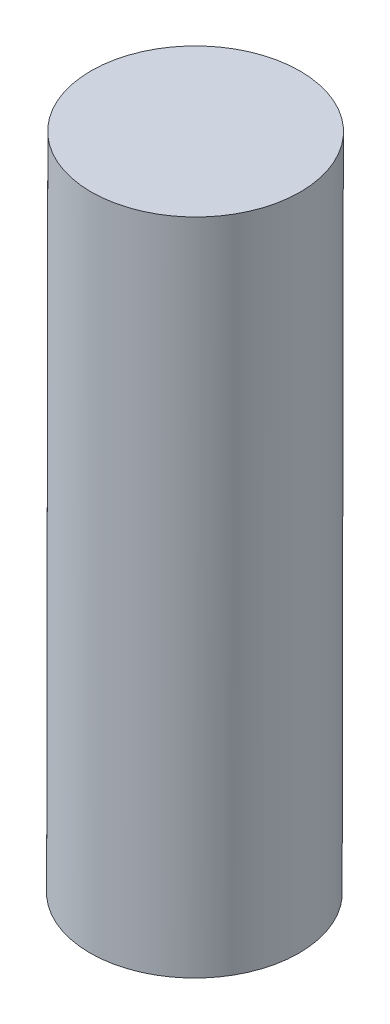
ISO-10303-21;
HEADER;
FILE_DESCRIPTION(('STEP AP214'),'2;1');
FILE_NAME('part.step','',(''),(''),'','','');
FILE_SCHEMA(('AUTOMOTIVE_DESIGN { 1 0 10303 214 1 1 1 1 }'));
ENDSEC;
DATA;
#1=APPLICATION_CONTEXT('core data for automotive mechanical design processes');
#2=APPLICATION_PROTOCOL_DEFINITION('international standard','automotive_design',2000,#1);
#3=PRODUCT_CONTEXT('',#1,'mechanical');
#4=PRODUCT('Part','Part','',(#3));
#5=PRODUCT_RELATED_PRODUCT_CATEGORY('part','',(#4));
#6=PRODUCT_DEFINITION_FORMATION('','',#4);
#7=PRODUCT_DEFINITION_CONTEXT('part definition',#1,'design');
#8=PRODUCT_DEFINITION('design','',#6,#7);
#9=PRODUCT_DEFINITION_SHAPE('','',#8);
#10=(LENGTH_UNIT() NAMED_UNIT(*) SI_UNIT(.MILLI.,.METRE.));
#11=(NAMED_UNIT(*) PLANE_ANGLE_UNIT() SI_UNIT($,.RADIAN.));
#12=(NAMED_UNIT(*) SI_UNIT($,.STERADIAN.) SOLID_ANGLE_UNIT());
#13=UNCERTAINTY_MEASURE_WITH_UNIT(LENGTH_MEASURE(1.E-05),#10,'distance_accuracy_value','');
#14=(GEOMETRIC_REPRESENTATION_CONTEXT(3) GLOBAL_UNCERTAINTY_ASSIGNED_CONTEXT((#13)) GLOBAL_UNIT_ASSIGNED_CONTEXT((#10,
#11,#12)) REPRESENTATION_CONTEXT('',''));
#15=CARTESIAN_POINT('',(0.,0.,0.));
#16=DIRECTION('',(0.,0.,1.));
#17=DIRECTION('',(1.,0.,0.));
#18=AXIS2_PLACEMENT_3D('',#15,#16,#17);
#19=CARTESIAN_POINT('',(-266.61706433789,133.219904817138,163.321796792769));
#20=DIRECTION('',(0.00176421332219243,0.999998443774466,1.17136488108813E-09));
#21=DIRECTION('',(-0.999998443774466,0.00176421332219243,0.));
#22=AXIS2_PLACEMENT_3D('',#19,#20,#21);
#23=PLANE('',#22);
#24=CARTESIAN_POINT('',(-266.61706433789,133.219904817138,163.321796792769));
#25=DIRECTION('',(0.00176421332219243,0.999998443774466,1.17136488108813E-09));
#26=DIRECTION('',(-0.999998443774466,0.00176421332219243,0.));
#27=AXIS2_PLACEMENT_3D('',#24,#25,#26);
#28=CIRCLE('',#27,4.69900000000002);
#29=CARTESIAN_POINT('',(-271.316057025187,133.228194855539,163.321796792769));
#30=VERTEX_POINT('',#29);
#31=EDGE_CURVE('E44',#30,#30,#28,.T.);
#32=ORIENTED_EDGE('',*,*,#31,.F.);
#33=EDGE_LOOP('',(#32));
#34=FACE_BOUND('',#33,.T.);
#35=ADVANCED_FACE('F38',(#34),#23,.F.);
#36=CARTESIAN_POINT('',(-266.564789525206,162.850522994416,163.321796827478));
#37=DIRECTION('',(0.00176421332219243,0.999998443774466,1.17136488108813E-09));
#38=DIRECTION('',(-0.999998443774466,0.00176421332219243,0.));
#39=AXIS2_PLACEMENT_3D('',#36,#37,#38);
#40=PLANE('',#39);
#41=CARTESIAN_POINT('',(-266.564789525206,162.850522994416,163.321796827478));
#42=DIRECTION('',(0.00176421332219243,0.999998443774466,1.17136488108813E-09));
#43=DIRECTION('',(-0.999998443774466,0.00176421332219243,0.));
#44=AXIS2_PLACEMENT_3D('',#41,#42,#43);
#45=CIRCLE('',#44,4.69900000000002);
#46=CARTESIAN_POINT('',(-271.263782212502,162.858813032817,163.321796827478));
#47=VERTEX_POINT('',#46);
#48=EDGE_CURVE('E11',#47,#47,#45,.T.);
#49=ORIENTED_EDGE('',*,*,#48,.T.);
#50=EDGE_LOOP('',(#49));
#51=FACE_BOUND('',#50,.T.);
#52=ADVANCED_FACE('F53',(#51),#40,.T.);
#53=CARTESIAN_POINT('',(-266.61706433789,133.219904817138,163.321796792769));
#54=DIRECTION('',(0.00176421332219243,0.999998443774466,1.17136488108813E-09));
#55=DIRECTION('',(-0.999998443774466,0.00176421332219243,0.));
#56=AXIS2_PLACEMENT_3D('',#53,#54,#55);
#57=CYLINDRICAL_SURFACE('',#56,4.69900000000002);
#58=ORIENTED_EDGE('',*,*,#48,.F.);
#59=EDGE_LOOP('',(#58));
#60=FACE_BOUND('',#59,.T.);
#61=ORIENTED_EDGE('',*,*,#31,.T.);
#62=EDGE_LOOP('',(#61));
#63=FACE_BOUND('',#62,.T.);
#64=ADVANCED_FACE('F50',(#60,#63),#57,.T.);
#65=CLOSED_SHELL('',(#35,#52,#64));
#66=MANIFOLD_SOLID_BREP('B2',#65);
#67=ADVANCED_BREP_SHAPE_REPRESENTATION('',(#18,#66),#14);
#68=SHAPE_DEFINITION_REPRESENTATION(#9,#67);
ENDSEC;
END-ISO-10303-21;
